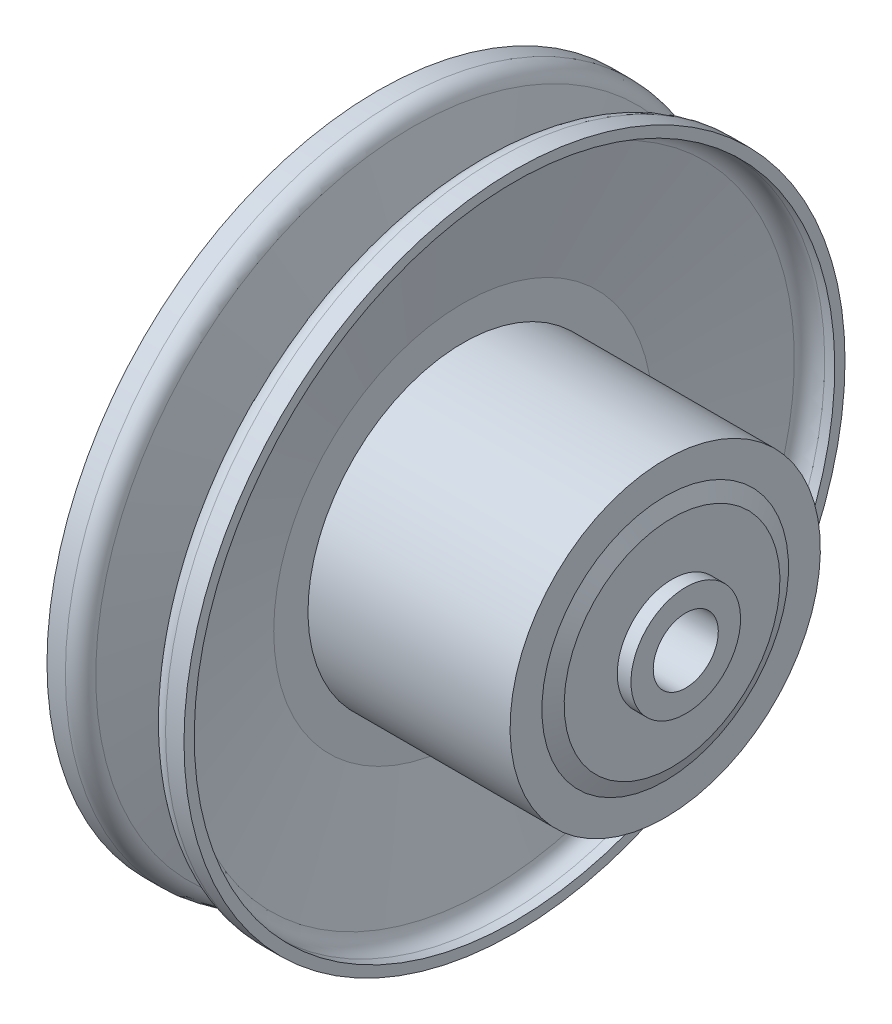
ISO-10303-21;
HEADER;
FILE_DESCRIPTION(('STEP AP214'),'2;1');
FILE_NAME('part.step','',(''),(''),'','','');
FILE_SCHEMA(('AUTOMOTIVE_DESIGN { 1 0 10303 214 1 1 1 1 }'));
ENDSEC;
DATA;
#1=APPLICATION_CONTEXT('core data for automotive mechanical design processes');
#2=APPLICATION_PROTOCOL_DEFINITION('international standard','automotive_design',2000,#1);
#3=PRODUCT_CONTEXT('',#1,'mechanical');
#4=PRODUCT('Part','Part','',(#3));
#5=PRODUCT_RELATED_PRODUCT_CATEGORY('part','',(#4));
#6=PRODUCT_DEFINITION_FORMATION('','',#4);
#7=PRODUCT_DEFINITION_CONTEXT('part definition',#1,'design');
#8=PRODUCT_DEFINITION('design','',#6,#7);
#9=PRODUCT_DEFINITION_SHAPE('','',#8);
#10=(LENGTH_UNIT() NAMED_UNIT(*) SI_UNIT(.MILLI.,.METRE.));
#11=(NAMED_UNIT(*) PLANE_ANGLE_UNIT() SI_UNIT($,.RADIAN.));
#12=(NAMED_UNIT(*) SI_UNIT($,.STERADIAN.) SOLID_ANGLE_UNIT());
#13=UNCERTAINTY_MEASURE_WITH_UNIT(LENGTH_MEASURE(1.E-05),#10,'distance_accuracy_value','');
#14=(GEOMETRIC_REPRESENTATION_CONTEXT(3) GLOBAL_UNCERTAINTY_ASSIGNED_CONTEXT((#13)) GLOBAL_UNIT_ASSIGNED_CONTEXT((#10,
#11,#12)) REPRESENTATION_CONTEXT('',''));
#15=CARTESIAN_POINT('',(0.,0.,0.));
#16=DIRECTION('',(0.,0.,1.));
#17=DIRECTION('',(1.,0.,0.));
#18=AXIS2_PLACEMENT_3D('',#15,#16,#17);
#19=CARTESIAN_POINT('',(-45.,0.,0.));
#20=DIRECTION('',(-1.,0.,0.));
#21=DIRECTION('',(0.,-1.,0.));
#22=AXIS2_PLACEMENT_3D('',#19,#20,#21);
#23=CYLINDRICAL_SURFACE('',#22,45.3);
#24=CARTESIAN_POINT('',(-35.,0.,0.));
#25=DIRECTION('',(-1.,0.,0.));
#26=DIRECTION('',(0.,-1.,0.));
#27=AXIS2_PLACEMENT_3D('',#24,#25,#26);
#28=CIRCLE('',#27,45.3);
#29=CARTESIAN_POINT('',(-35.,-45.3,0.));
#30=VERTEX_POINT('',#29);
#31=EDGE_CURVE('E166',#30,#30,#28,.T.);
#32=ORIENTED_EDGE('',*,*,#31,.F.);
#33=EDGE_LOOP('',(#32));
#34=FACE_BOUND('',#33,.T.);
#35=CARTESIAN_POINT('',(-30.,0.,0.));
#36=DIRECTION('',(-1.,0.,0.));
#37=DIRECTION('',(0.,-1.,0.));
#38=AXIS2_PLACEMENT_3D('',#35,#36,#37);
#39=CIRCLE('',#38,45.3);
#40=CARTESIAN_POINT('',(-30.,-45.3,0.));
#41=VERTEX_POINT('',#40);
#42=EDGE_CURVE('E103',#41,#41,#39,.T.);
#43=ORIENTED_EDGE('',*,*,#42,.T.);
#44=EDGE_LOOP('',(#43));
#45=FACE_BOUND('',#44,.T.);
#46=ADVANCED_FACE('F37',(#34,#45),#23,.T.);
#47=CARTESIAN_POINT('',(-35.,45.3,0.));
#48=DIRECTION('',(1.,0.,0.));
#49=DIRECTION('',(0.,1.,0.));
#50=AXIS2_PLACEMENT_3D('',#47,#48,#49);
#51=PLANE('',#50);
#52=CARTESIAN_POINT('',(-35.,0.,0.));
#53=DIRECTION('',(-1.,0.,0.));
#54=DIRECTION('',(0.,-1.,0.));
#55=AXIS2_PLACEMENT_3D('',#52,#53,#54);
#56=CIRCLE('',#55,14.);
#57=CARTESIAN_POINT('',(-35.,-14.,0.));
#58=VERTEX_POINT('',#57);
#59=EDGE_CURVE('E163',#58,#58,#56,.T.);
#60=ORIENTED_EDGE('',*,*,#59,.F.);
#61=EDGE_LOOP('',(#60));
#62=FACE_BOUND('',#61,.T.);
#63=ORIENTED_EDGE('',*,*,#31,.T.);
#64=EDGE_LOOP('',(#63));
#65=FACE_BOUND('',#64,.T.);
#66=ADVANCED_FACE('F215',(#62,#65),#51,.F.);
#67=CARTESIAN_POINT('',(-45.,0.,0.));
#68=DIRECTION('',(-1.,0.,0.));
#69=DIRECTION('',(0.,-1.,0.));
#70=AXIS2_PLACEMENT_3D('',#67,#68,#69);
#71=CYLINDRICAL_SURFACE('',#70,14.);
#72=CARTESIAN_POINT('',(-40.,0.,0.));
#73=DIRECTION('',(-1.,0.,0.));
#74=DIRECTION('',(0.,-1.,0.));
#75=AXIS2_PLACEMENT_3D('',#72,#73,#74);
#76=CIRCLE('',#75,14.);
#77=CARTESIAN_POINT('',(-40.,-14.,0.));
#78=VERTEX_POINT('',#77);
#79=EDGE_CURVE('E160',#78,#78,#76,.T.);
#80=ORIENTED_EDGE('',*,*,#79,.F.);
#81=EDGE_LOOP('',(#80));
#82=FACE_BOUND('',#81,.T.);
#83=ORIENTED_EDGE('',*,*,#59,.T.);
#84=EDGE_LOOP('',(#83));
#85=FACE_BOUND('',#84,.T.);
#86=ADVANCED_FACE('F221',(#82,#85),#71,.T.);
#87=CARTESIAN_POINT('',(-40.,14.,0.));
#88=DIRECTION('',(1.,0.,0.));
#89=DIRECTION('',(0.,1.,0.));
#90=AXIS2_PLACEMENT_3D('',#87,#88,#89);
#91=PLANE('',#90);
#92=CARTESIAN_POINT('',(-40.,0.,0.));
#93=DIRECTION('',(-1.,0.,0.));
#94=DIRECTION('',(0.,-1.,0.));
#95=AXIS2_PLACEMENT_3D('',#92,#93,#94);
#96=CIRCLE('',#95,9.49999999999999);
#97=CARTESIAN_POINT('',(-40.,-9.49999999999999,0.));
#98=VERTEX_POINT('',#97);
#99=EDGE_CURVE('E157',#98,#98,#96,.T.);
#100=ORIENTED_EDGE('',*,*,#99,.F.);
#101=EDGE_LOOP('',(#100));
#102=FACE_BOUND('',#101,.T.);
#103=ORIENTED_EDGE('',*,*,#79,.T.);
#104=EDGE_LOOP('',(#103));
#105=FACE_BOUND('',#104,.T.);
#106=ADVANCED_FACE('F338',(#102,#105),#91,.F.);
#107=CARTESIAN_POINT('',(-45.,0.,0.));
#108=DIRECTION('',(-1.,0.,0.));
#109=DIRECTION('',(0.,-1.,0.));
#110=AXIS2_PLACEMENT_3D('',#107,#108,#109);
#111=CYLINDRICAL_SURFACE('',#110,9.49999999999999);
#112=DIRECTION('',(-1.,0.,0.));
#113=VECTOR('',#112,1.);
#114=CARTESIAN_POINT('',(-45.,9.16515138991167,-2.5));
#115=LINE('',#114,#113);
#116=CARTESIAN_POINT('',(7.,9.16515138991168,-2.5));
#117=VERTEX_POINT('',#116);
#118=CARTESIAN_POINT('',(-28.,9.16515138991167,-2.5));
#119=VERTEX_POINT('',#118);
#120=EDGE_CURVE('E45',#117,#119,#115,.T.);
#121=ORIENTED_EDGE('',*,*,#120,.T.);
#122=CARTESIAN_POINT('',(-28.,0.,0.));
#123=DIRECTION('',(-1.,0.,0.));
#124=DIRECTION('',(0.,0.,1.));
#125=AXIS2_PLACEMENT_3D('',#122,#123,#124);
#126=CIRCLE('',#125,9.49999999999999);
#127=CARTESIAN_POINT('',(-28.,9.16515138991167,2.5));
#128=VERTEX_POINT('',#127);
#129=EDGE_CURVE('E12',#119,#128,#126,.F.);
#130=ORIENTED_EDGE('',*,*,#129,.T.);
#131=DIRECTION('',(-1.,0.,0.));
#132=VECTOR('',#131,1.);
#133=CARTESIAN_POINT('',(-45.,9.16515138991167,2.5));
#134=LINE('',#133,#132);
#135=CARTESIAN_POINT('',(7.,9.16515138991167,2.5));
#136=VERTEX_POINT('',#135);
#137=EDGE_CURVE('E196',#128,#136,#134,.F.);
#138=ORIENTED_EDGE('',*,*,#137,.T.);
#139=CARTESIAN_POINT('',(7.,0.,0.));
#140=DIRECTION('',(-1.,0.,0.));
#141=DIRECTION('',(0.,-1.,0.));
#142=AXIS2_PLACEMENT_3D('',#139,#140,#141);
#143=CIRCLE('',#142,9.49999999999999);
#144=EDGE_CURVE('E193',#117,#136,#143,.F.);
#145=ORIENTED_EDGE('',*,*,#144,.F.);
#146=EDGE_LOOP('',(#121,#130,#138,#145));
#147=FACE_BOUND('',#146,.T.);
#148=CARTESIAN_POINT('',(45.,0.,0.));
#149=DIRECTION('',(-1.,0.,0.));
#150=DIRECTION('',(0.,-1.,0.));
#151=AXIS2_PLACEMENT_3D('',#148,#149,#150);
#152=CIRCLE('',#151,9.49999999999998);
#153=CARTESIAN_POINT('',(45.,-9.49999999999997,0.));
#154=VERTEX_POINT('',#153);
#155=EDGE_CURVE('E154',#154,#154,#152,.T.);
#156=ORIENTED_EDGE('',*,*,#155,.F.);
#157=EDGE_LOOP('',(#156));
#158=FACE_BOUND('',#157,.T.);
#159=ORIENTED_EDGE('',*,*,#99,.T.);
#160=EDGE_LOOP('',(#159));
#161=FACE_BOUND('',#160,.T.);
#162=ADVANCED_FACE('F197',(#147,#158,#161),#111,.F.);
#163=CARTESIAN_POINT('',(45.,9.5,0.));
#164=DIRECTION('',(-1.,0.,0.));
#165=DIRECTION('',(0.,-1.,0.));
#166=AXIS2_PLACEMENT_3D('',#163,#164,#165);
#167=PLANE('',#166);
#168=CARTESIAN_POINT('',(45.,0.,0.));
#169=DIRECTION('',(-1.,0.,0.));
#170=DIRECTION('',(0.,-1.,0.));
#171=AXIS2_PLACEMENT_3D('',#168,#169,#170);
#172=CIRCLE('',#171,16.);
#173=CARTESIAN_POINT('',(45.,-16.,0.));
#174=VERTEX_POINT('',#173);
#175=EDGE_CURVE('E151',#174,#174,#172,.T.);
#176=ORIENTED_EDGE('',*,*,#175,.F.);
#177=EDGE_LOOP('',(#176));
#178=FACE_BOUND('',#177,.T.);
#179=ORIENTED_EDGE('',*,*,#155,.T.);
#180=EDGE_LOOP('',(#179));
#181=FACE_BOUND('',#180,.T.);
#182=ADVANCED_FACE('F331',(#178,#181),#167,.F.);
#183=CARTESIAN_POINT('',(-45.,0.,0.));
#184=DIRECTION('',(-1.,0.,0.));
#185=DIRECTION('',(0.,-1.,0.));
#186=AXIS2_PLACEMENT_3D('',#183,#184,#185);
#187=CYLINDRICAL_SURFACE('',#186,16.);
#188=CARTESIAN_POINT('',(41.,0.,0.));
#189=DIRECTION('',(-1.,0.,0.));
#190=DIRECTION('',(0.,-1.,0.));
#191=AXIS2_PLACEMENT_3D('',#188,#189,#190);
#192=CIRCLE('',#191,16.);
#193=CARTESIAN_POINT('',(41.,-16.,0.));
#194=VERTEX_POINT('',#193);
#195=EDGE_CURVE('E148',#194,#194,#192,.T.);
#196=ORIENTED_EDGE('',*,*,#195,.F.);
#197=EDGE_LOOP('',(#196));
#198=FACE_BOUND('',#197,.T.);
#199=ORIENTED_EDGE('',*,*,#175,.T.);
#200=EDGE_LOOP('',(#199));
#201=FACE_BOUND('',#200,.T.);
#202=ADVANCED_FACE('F327',(#198,#201),#187,.T.);
#203=CARTESIAN_POINT('',(41.,16.,0.));
#204=DIRECTION('',(-1.,0.,0.));
#205=DIRECTION('',(0.,-1.,0.));
#206=AXIS2_PLACEMENT_3D('',#203,#204,#205);
#207=PLANE('',#206);
#208=CARTESIAN_POINT('',(41.,0.,0.));
#209=DIRECTION('',(-1.,0.,0.));
#210=DIRECTION('',(0.,-1.,0.));
#211=AXIS2_PLACEMENT_3D('',#208,#209,#210);
#212=CIRCLE('',#211,31.5);
#213=CARTESIAN_POINT('',(41.,-31.5,0.));
#214=VERTEX_POINT('',#213);
#215=EDGE_CURVE('E145',#214,#214,#212,.T.);
#216=ORIENTED_EDGE('',*,*,#215,.F.);
#217=EDGE_LOOP('',(#216));
#218=FACE_BOUND('',#217,.T.);
#219=ORIENTED_EDGE('',*,*,#195,.T.);
#220=EDGE_LOOP('',(#219));
#221=FACE_BOUND('',#220,.T.);
#222=ADVANCED_FACE('F323',(#218,#221),#207,.F.);
#223=CARTESIAN_POINT('',(41.,0.,0.));
#224=DIRECTION('',(-1.,0.,0.));
#225=DIRECTION('',(0.,-1.,0.));
#226=AXIS2_PLACEMENT_3D('',#223,#224,#225);
#227=CONICAL_SURFACE('',#226,31.5,1.15257199721567);
#228=CARTESIAN_POINT('',(39.,0.,0.));
#229=DIRECTION('',(-1.,0.,0.));
#230=DIRECTION('',(0.,-1.,0.));
#231=AXIS2_PLACEMENT_3D('',#228,#229,#230);
#232=CIRCLE('',#231,36.);
#233=CARTESIAN_POINT('',(39.,-36.,0.));
#234=VERTEX_POINT('',#233);
#235=EDGE_CURVE('E142',#234,#234,#232,.T.);
#236=ORIENTED_EDGE('',*,*,#235,.F.);
#237=EDGE_LOOP('',(#236));
#238=FACE_BOUND('',#237,.T.);
#239=ORIENTED_EDGE('',*,*,#215,.T.);
#240=EDGE_LOOP('',(#239));
#241=FACE_BOUND('',#240,.T.);
#242=ADVANCED_FACE('F319',(#238,#241),#227,.T.);
#243=CARTESIAN_POINT('',(39.,36.,0.));
#244=DIRECTION('',(-1.,0.,0.));
#245=DIRECTION('',(0.,-1.,0.));
#246=AXIS2_PLACEMENT_3D('',#243,#244,#245);
#247=PLANE('',#246);
#248=CARTESIAN_POINT('',(39.,0.,0.));
#249=DIRECTION('',(-1.,0.,0.));
#250=DIRECTION('',(0.,-1.,0.));
#251=AXIS2_PLACEMENT_3D('',#248,#249,#250);
#252=CIRCLE('',#251,45.3);
#253=CARTESIAN_POINT('',(39.,-45.3,0.));
#254=VERTEX_POINT('',#253);
#255=EDGE_CURVE('E139',#254,#254,#252,.T.);
#256=ORIENTED_EDGE('',*,*,#255,.F.);
#257=EDGE_LOOP('',(#256));
#258=FACE_BOUND('',#257,.T.);
#259=ORIENTED_EDGE('',*,*,#235,.T.);
#260=EDGE_LOOP('',(#259));
#261=FACE_BOUND('',#260,.T.);
#262=ADVANCED_FACE('F315',(#258,#261),#247,.F.);
#263=CARTESIAN_POINT('',(-45.,0.,0.));
#264=DIRECTION('',(-1.,0.,0.));
#265=DIRECTION('',(0.,-1.,0.));
#266=AXIS2_PLACEMENT_3D('',#263,#264,#265);
#267=CYLINDRICAL_SURFACE('',#266,45.3);
#268=CARTESIAN_POINT('',(-20.,0.,0.));
#269=DIRECTION('',(-1.,0.,0.));
#270=DIRECTION('',(0.,-1.,0.));
#271=AXIS2_PLACEMENT_3D('',#268,#269,#270);
#272=CIRCLE('',#271,45.3);
#273=CARTESIAN_POINT('',(-20.,-45.3,0.));
#274=VERTEX_POINT('',#273);
#275=EDGE_CURVE('E136',#274,#274,#272,.T.);
#276=ORIENTED_EDGE('',*,*,#275,.F.);
#277=EDGE_LOOP('',(#276));
#278=FACE_BOUND('',#277,.T.);
#279=ORIENTED_EDGE('',*,*,#255,.T.);
#280=EDGE_LOOP('',(#279));
#281=FACE_BOUND('',#280,.T.);
#282=ADVANCED_FACE('F311',(#278,#281),#267,.T.);
#283=CARTESIAN_POINT('',(-20.,45.3,0.));
#284=DIRECTION('',(-1.,0.,0.));
#285=DIRECTION('',(0.,-1.,0.));
#286=AXIS2_PLACEMENT_3D('',#283,#284,#285);
#287=PLANE('',#286);
#288=CARTESIAN_POINT('',(-20.,0.,0.));
#289=DIRECTION('',(-1.,0.,0.));
#290=DIRECTION('',(0.,-1.,0.));
#291=AXIS2_PLACEMENT_3D('',#288,#289,#290);
#292=CIRCLE('',#291,55.3);
#293=CARTESIAN_POINT('',(-20.,-55.3,0.));
#294=VERTEX_POINT('',#293);
#295=EDGE_CURVE('E133',#294,#294,#292,.T.);
#296=ORIENTED_EDGE('',*,*,#295,.F.);
#297=EDGE_LOOP('',(#296));
#298=FACE_BOUND('',#297,.T.);
#299=ORIENTED_EDGE('',*,*,#275,.T.);
#300=EDGE_LOOP('',(#299));
#301=FACE_BOUND('',#300,.T.);
#302=ADVANCED_FACE('F307',(#298,#301),#287,.F.);
#303=CARTESIAN_POINT('',(-20.,0.,0.));
#304=DIRECTION('',(1.,0.,0.));
#305=DIRECTION('',(0.,1.,0.));
#306=AXIS2_PLACEMENT_3D('',#303,#304,#305);
#307=CONICAL_SURFACE('',#306,55.3,1.36435578748401);
#308=CARTESIAN_POINT('',(-12.8324844774488,0.,0.));
#309=DIRECTION('',(1.,0.,0.));
#310=DIRECTION('',(0.,1.,0.));
#311=AXIS2_PLACEMENT_3D('',#308,#309,#310);
#312=CIRCLE('',#311,89.5248866201821);
#313=CARTESIAN_POINT('',(-12.8324844774488,89.5248866201821,0.));
#314=VERTEX_POINT('',#313);
#315=EDGE_CURVE('E172',#314,#314,#312,.T.);
#316=ORIENTED_EDGE('',*,*,#315,.T.);
#317=EDGE_LOOP('',(#316));
#318=FACE_BOUND('',#317,.T.);
#319=ORIENTED_EDGE('',*,*,#295,.T.);
#320=EDGE_LOOP('',(#319));
#321=FACE_BOUND('',#320,.T.);
#322=ADVANCED_FACE('F303',(#318,#321),#307,.F.);
#323=CARTESIAN_POINT('',(-45.,0.,0.));
#324=DIRECTION('',(-1.,0.,0.));
#325=DIRECTION('',(0.,-1.,0.));
#326=AXIS2_PLACEMENT_3D('',#323,#324,#325);
#327=CYLINDRICAL_SURFACE('',#326,93.5);
#328=CARTESIAN_POINT('',(-7.93865086607908,0.,0.));
#329=DIRECTION('',(-1.,0.,0.));
#330=DIRECTION('',(0.,-1.,0.));
#331=AXIS2_PLACEMENT_3D('',#328,#329,#330);
#332=CIRCLE('',#331,93.5);
#333=CARTESIAN_POINT('',(-7.93865086607906,-93.5,0.));
#334=VERTEX_POINT('',#333);
#335=EDGE_CURVE('E169',#334,#334,#332,.T.);
#336=ORIENTED_EDGE('',*,*,#335,.T.);
#337=EDGE_LOOP('',(#336));
#338=FACE_BOUND('',#337,.T.);
#339=CARTESIAN_POINT('',(-5.,0.,0.));
#340=DIRECTION('',(-1.,0.,0.));
#341=DIRECTION('',(0.,-1.,0.));
#342=AXIS2_PLACEMENT_3D('',#339,#340,#341);
#343=CIRCLE('',#342,93.5);
#344=CARTESIAN_POINT('',(-4.99999999999998,-93.5,0.));
#345=VERTEX_POINT('',#344);
#346=EDGE_CURVE('E130',#345,#345,#343,.T.);
#347=ORIENTED_EDGE('',*,*,#346,.F.);
#348=EDGE_LOOP('',(#347));
#349=FACE_BOUND('',#348,.T.);
#350=ADVANCED_FACE('F299',(#338,#349),#327,.F.);
#351=CARTESIAN_POINT('',(-5.00000000000001,93.5,0.));
#352=DIRECTION('',(-1.,0.,0.));
#353=DIRECTION('',(0.,-1.,0.));
#354=AXIS2_PLACEMENT_3D('',#351,#352,#353);
#355=PLANE('',#354);
#356=CARTESIAN_POINT('',(-4.99999999999998,0.,0.));
#357=DIRECTION('',(-1.,0.,0.));
#358=DIRECTION('',(0.,-1.,0.));
#359=AXIS2_PLACEMENT_3D('',#356,#357,#358);
#360=CIRCLE('',#359,96.5);
#361=CARTESIAN_POINT('',(-4.99999999999997,-96.5,0.));
#362=VERTEX_POINT('',#361);
#363=EDGE_CURVE('E127',#362,#362,#360,.T.);
#364=ORIENTED_EDGE('',*,*,#363,.F.);
#365=EDGE_LOOP('',(#364));
#366=FACE_BOUND('',#365,.T.);
#367=ORIENTED_EDGE('',*,*,#346,.T.);
#368=EDGE_LOOP('',(#367));
#369=FACE_BOUND('',#368,.T.);
#370=ADVANCED_FACE('F295',(#366,#369),#355,.F.);
#371=CARTESIAN_POINT('',(-45.,0.,0.));
#372=DIRECTION('',(-1.,0.,0.));
#373=DIRECTION('',(0.,-1.,0.));
#374=AXIS2_PLACEMENT_3D('',#371,#372,#373);
#375=CYLINDRICAL_SURFACE('',#374,96.5);
#376=CARTESIAN_POINT('',(-10.3754603464316,0.,0.));
#377=DIRECTION('',(1.,0.,0.));
#378=DIRECTION('',(0.,1.,0.));
#379=AXIS2_PLACEMENT_3D('',#376,#377,#378);
#380=CIRCLE('',#379,96.5);
#381=CARTESIAN_POINT('',(-10.3754603464317,96.5,0.));
#382=VERTEX_POINT('',#381);
#383=EDGE_CURVE('E178',#382,#382,#380,.T.);
#384=ORIENTED_EDGE('',*,*,#383,.T.);
#385=EDGE_LOOP('',(#384));
#386=FACE_BOUND('',#385,.T.);
#387=ORIENTED_EDGE('',*,*,#363,.T.);
#388=EDGE_LOOP('',(#387));
#389=FACE_BOUND('',#388,.T.);
#390=ADVANCED_FACE('F291',(#386,#389),#375,.T.);
#391=CARTESIAN_POINT('',(-14.4368094803525,0.,0.));
#392=DIRECTION('',(1.,0.,0.));
#393=DIRECTION('',(0.,1.,0.));
#394=AXIS2_PLACEMENT_3D('',#391,#392,#393);
#395=CONICAL_SURFACE('',#394,96.5,1.36435578748401);
#396=CARTESIAN_POINT('',(-15.2692939578013,0.,0.));
#397=DIRECTION('',(-1.,0.,0.));
#398=DIRECTION('',(0.,-1.,0.));
#399=AXIS2_PLACEMENT_3D('',#396,#397,#398);
#400=CIRCLE('',#399,92.5248866201821);
#401=CARTESIAN_POINT('',(-15.2692939578013,-92.5248866201821,0.));
#402=VERTEX_POINT('',#401);
#403=EDGE_CURVE('E175',#402,#402,#400,.T.);
#404=ORIENTED_EDGE('',*,*,#403,.T.);
#405=EDGE_LOOP('',(#404));
#406=FACE_BOUND('',#405,.T.);
#407=CARTESIAN_POINT('',(-23.,0.,0.));
#408=DIRECTION('',(-1.,0.,0.));
#409=DIRECTION('',(0.,-1.,0.));
#410=AXIS2_PLACEMENT_3D('',#407,#408,#409);
#411=CIRCLE('',#410,55.6107652686834);
#412=CARTESIAN_POINT('',(-23.,-55.6107652686834,0.));
#413=VERTEX_POINT('',#412);
#414=EDGE_CURVE('E124',#413,#413,#411,.T.);
#415=ORIENTED_EDGE('',*,*,#414,.F.);
#416=EDGE_LOOP('',(#415));
#417=FACE_BOUND('',#416,.T.);
#418=ADVANCED_FACE('F287',(#406,#417),#395,.T.);
#419=CARTESIAN_POINT('',(-23.,55.6107652686834,0.));
#420=DIRECTION('',(1.,0.,0.));
#421=DIRECTION('',(0.,1.,0.));
#422=AXIS2_PLACEMENT_3D('',#419,#420,#421);
#423=PLANE('',#422);
#424=CARTESIAN_POINT('',(-23.,0.,0.));
#425=DIRECTION('',(-1.,0.,0.));
#426=DIRECTION('',(0.,-1.,0.));
#427=AXIS2_PLACEMENT_3D('',#424,#425,#426);
#428=CIRCLE('',#427,35.);
#429=CARTESIAN_POINT('',(-23.,-35.,0.));
#430=VERTEX_POINT('',#429);
#431=EDGE_CURVE('E121',#430,#430,#428,.T.);
#432=ORIENTED_EDGE('',*,*,#431,.F.);
#433=EDGE_LOOP('',(#432));
#434=FACE_BOUND('',#433,.T.);
#435=ORIENTED_EDGE('',*,*,#414,.T.);
#436=EDGE_LOOP('',(#435));
#437=FACE_BOUND('',#436,.T.);
#438=ADVANCED_FACE('F283',(#434,#437),#423,.F.);
#439=CARTESIAN_POINT('',(-45.,0.,0.));
#440=DIRECTION('',(-1.,0.,0.));
#441=DIRECTION('',(0.,-1.,0.));
#442=AXIS2_PLACEMENT_3D('',#439,#440,#441);
#443=CYLINDRICAL_SURFACE('',#442,35.);
#444=CARTESIAN_POINT('',(-27.,0.,0.));
#445=DIRECTION('',(-1.,0.,0.));
#446=DIRECTION('',(0.,-1.,0.));
#447=AXIS2_PLACEMENT_3D('',#444,#445,#446);
#448=CIRCLE('',#447,35.);
#449=CARTESIAN_POINT('',(-27.,-35.,0.));
#450=VERTEX_POINT('',#449);
#451=EDGE_CURVE('E118',#450,#450,#448,.T.);
#452=ORIENTED_EDGE('',*,*,#451,.F.);
#453=EDGE_LOOP('',(#452));
#454=FACE_BOUND('',#453,.T.);
#455=ORIENTED_EDGE('',*,*,#431,.T.);
#456=EDGE_LOOP('',(#455));
#457=FACE_BOUND('',#456,.T.);
#458=ADVANCED_FACE('F279',(#454,#457),#443,.T.);
#459=CARTESIAN_POINT('',(-27.,35.,0.));
#460=DIRECTION('',(-1.,0.,0.));
#461=DIRECTION('',(0.,-1.,0.));
#462=AXIS2_PLACEMENT_3D('',#459,#460,#461);
#463=PLANE('',#462);
#464=CARTESIAN_POINT('',(-27.,0.,0.));
#465=DIRECTION('',(-1.,0.,0.));
#466=DIRECTION('',(0.,-1.,0.));
#467=AXIS2_PLACEMENT_3D('',#464,#465,#466);
#468=CIRCLE('',#467,55.6107652686834);
#469=CARTESIAN_POINT('',(-27.,-55.6107652686834,0.));
#470=VERTEX_POINT('',#469);
#471=EDGE_CURVE('E115',#470,#470,#468,.T.);
#472=ORIENTED_EDGE('',*,*,#471,.F.);
#473=EDGE_LOOP('',(#472));
#474=FACE_BOUND('',#473,.T.);
#475=ORIENTED_EDGE('',*,*,#451,.T.);
#476=EDGE_LOOP('',(#475));
#477=FACE_BOUND('',#476,.T.);
#478=ADVANCED_FACE('F275',(#474,#477),#463,.F.);
#479=CARTESIAN_POINT('',(-27.,0.,0.));
#480=DIRECTION('',(-1.,0.,0.));
#481=DIRECTION('',(0.,-1.,0.));
#482=AXIS2_PLACEMENT_3D('',#479,#480,#481);
#483=CONICAL_SURFACE('',#482,55.6107652686834,1.36435578748401);
#484=CARTESIAN_POINT('',(-34.7307060421987,0.,0.));
#485=DIRECTION('',(1.,0.,0.));
#486=DIRECTION('',(0.,1.,0.));
#487=AXIS2_PLACEMENT_3D('',#484,#485,#486);
#488=CIRCLE('',#487,92.5248866201821);
#489=CARTESIAN_POINT('',(-34.7307060421987,92.5248866201821,0.));
#490=VERTEX_POINT('',#489);
#491=EDGE_CURVE('E190',#490,#490,#488,.T.);
#492=ORIENTED_EDGE('',*,*,#491,.T.);
#493=EDGE_LOOP('',(#492));
#494=FACE_BOUND('',#493,.T.);
#495=ORIENTED_EDGE('',*,*,#471,.T.);
#496=EDGE_LOOP('',(#495));
#497=FACE_BOUND('',#496,.T.);
#498=ADVANCED_FACE('F271',(#494,#497),#483,.T.);
#499=CARTESIAN_POINT('',(-45.,0.,0.));
#500=DIRECTION('',(-1.,0.,0.));
#501=DIRECTION('',(0.,-1.,0.));
#502=AXIS2_PLACEMENT_3D('',#499,#500,#501);
#503=CYLINDRICAL_SURFACE('',#502,96.5);
#504=CARTESIAN_POINT('',(-39.6245396535684,0.,0.));
#505=DIRECTION('',(1.,0.,0.));
#506=DIRECTION('',(0.,1.,0.));
#507=AXIS2_PLACEMENT_3D('',#504,#505,#506);
#508=CIRCLE('',#507,96.5);
#509=CARTESIAN_POINT('',(-39.6245396535684,96.5,0.));
#510=VERTEX_POINT('',#509);
#511=EDGE_CURVE('E187',#510,#510,#508,.F.);
#512=ORIENTED_EDGE('',*,*,#511,.T.);
#513=EDGE_LOOP('',(#512));
#514=FACE_BOUND('',#513,.T.);
#515=CARTESIAN_POINT('',(-45.,0.,0.));
#516=DIRECTION('',(-1.,0.,0.));
#517=DIRECTION('',(0.,-1.,0.));
#518=AXIS2_PLACEMENT_3D('',#515,#516,#517);
#519=CIRCLE('',#518,96.5);
#520=CARTESIAN_POINT('',(-45.,-96.5,0.));
#521=VERTEX_POINT('',#520);
#522=EDGE_CURVE('E112',#521,#521,#519,.T.);
#523=ORIENTED_EDGE('',*,*,#522,.F.);
#524=EDGE_LOOP('',(#523));
#525=FACE_BOUND('',#524,.T.);
#526=ADVANCED_FACE('F267',(#514,#525),#503,.T.);
#527=CARTESIAN_POINT('',(-45.,96.5,0.));
#528=DIRECTION('',(1.,0.,0.));
#529=DIRECTION('',(0.,1.,0.));
#530=AXIS2_PLACEMENT_3D('',#527,#528,#529);
#531=PLANE('',#530);
#532=CARTESIAN_POINT('',(-45.,0.,0.));
#533=DIRECTION('',(-1.,0.,0.));
#534=DIRECTION('',(0.,-1.,0.));
#535=AXIS2_PLACEMENT_3D('',#532,#533,#534);
#536=CIRCLE('',#535,93.5);
#537=CARTESIAN_POINT('',(-45.,-93.5,0.));
#538=VERTEX_POINT('',#537);
#539=EDGE_CURVE('E109',#538,#538,#536,.T.);
#540=ORIENTED_EDGE('',*,*,#539,.F.);
#541=EDGE_LOOP('',(#540));
#542=FACE_BOUND('',#541,.T.);
#543=ORIENTED_EDGE('',*,*,#522,.T.);
#544=EDGE_LOOP('',(#543));
#545=FACE_BOUND('',#544,.T.);
#546=ADVANCED_FACE('F263',(#542,#545),#531,.F.);
#547=CARTESIAN_POINT('',(-45.,0.,0.));
#548=DIRECTION('',(-1.,0.,0.));
#549=DIRECTION('',(0.,-1.,0.));
#550=AXIS2_PLACEMENT_3D('',#547,#548,#549);
#551=CYLINDRICAL_SURFACE('',#550,93.5);
#552=CARTESIAN_POINT('',(-42.0613491339209,0.,0.));
#553=DIRECTION('',(-1.,0.,0.));
#554=DIRECTION('',(0.,-1.,0.));
#555=AXIS2_PLACEMENT_3D('',#552,#553,#554);
#556=CIRCLE('',#555,93.5);
#557=CARTESIAN_POINT('',(-42.0613491339209,-93.5,0.));
#558=VERTEX_POINT('',#557);
#559=EDGE_CURVE('E184',#558,#558,#556,.F.);
#560=ORIENTED_EDGE('',*,*,#559,.T.);
#561=EDGE_LOOP('',(#560));
#562=FACE_BOUND('',#561,.T.);
#563=ORIENTED_EDGE('',*,*,#539,.T.);
#564=EDGE_LOOP('',(#563));
#565=FACE_BOUND('',#564,.T.);
#566=ADVANCED_FACE('F250',(#562,#565),#551,.F.);
#567=CARTESIAN_POINT('',(-38.,0.,0.));
#568=DIRECTION('',(-1.,0.,0.));
#569=DIRECTION('',(0.,-1.,0.));
#570=AXIS2_PLACEMENT_3D('',#567,#568,#569);
#571=CONICAL_SURFACE('',#570,93.5,1.36435578748401);
#572=CARTESIAN_POINT('',(-37.1675155225512,0.,0.));
#573=DIRECTION('',(-1.,0.,0.));
#574=DIRECTION('',(0.,-1.,0.));
#575=AXIS2_PLACEMENT_3D('',#572,#573,#574);
#576=CIRCLE('',#575,89.5248866201821);
#577=CARTESIAN_POINT('',(-37.1675155225512,-89.5248866201821,0.));
#578=VERTEX_POINT('',#577);
#579=EDGE_CURVE('E181',#578,#578,#576,.T.);
#580=ORIENTED_EDGE('',*,*,#579,.T.);
#581=EDGE_LOOP('',(#580));
#582=FACE_BOUND('',#581,.T.);
#583=CARTESIAN_POINT('',(-30.,0.,0.));
#584=DIRECTION('',(-1.,0.,0.));
#585=DIRECTION('',(0.,-1.,0.));
#586=AXIS2_PLACEMENT_3D('',#583,#584,#585);
#587=CIRCLE('',#586,55.3);
#588=CARTESIAN_POINT('',(-30.,-55.3,0.));
#589=VERTEX_POINT('',#588);
#590=EDGE_CURVE('E106',#589,#589,#587,.T.);
#591=ORIENTED_EDGE('',*,*,#590,.F.);
#592=EDGE_LOOP('',(#591));
#593=FACE_BOUND('',#592,.T.);
#594=ADVANCED_FACE('F247',(#582,#593),#571,.F.);
#595=CARTESIAN_POINT('',(-30.,55.3,0.));
#596=DIRECTION('',(1.,0.,0.));
#597=DIRECTION('',(0.,1.,0.));
#598=AXIS2_PLACEMENT_3D('',#595,#596,#597);
#599=PLANE('',#598);
#600=ORIENTED_EDGE('',*,*,#42,.F.);
#601=EDGE_LOOP('',(#600));
#602=FACE_BOUND('',#601,.T.);
#603=ORIENTED_EDGE('',*,*,#590,.T.);
#604=EDGE_LOOP('',(#603));
#605=FACE_BOUND('',#604,.T.);
#606=ADVANCED_FACE('F232',(#602,#605),#599,.F.);
#607=CARTESIAN_POINT('',(-7.93865086607908,0.,0.));
#608=DIRECTION('',(-1.,0.,0.));
#609=DIRECTION('',(0.,-1.,0.));
#610=AXIS2_PLACEMENT_3D('',#607,#608,#609);
#611=TOROIDAL_SURFACE('',#610,88.5,5.);
#612=ORIENTED_EDGE('',*,*,#315,.F.);
#613=EDGE_LOOP('',(#612));
#614=FACE_BOUND('',#613,.T.);
#615=ORIENTED_EDGE('',*,*,#335,.F.);
#616=EDGE_LOOP('',(#615));
#617=FACE_BOUND('',#616,.T.);
#618=ADVANCED_FACE('F228',(#614,#617),#611,.F.);
#619=CARTESIAN_POINT('',(-10.3754603464316,0.,0.));
#620=DIRECTION('',(1.,0.,0.));
#621=DIRECTION('',(0.,1.,0.));
#622=AXIS2_PLACEMENT_3D('',#619,#620,#621);
#623=TOROIDAL_SURFACE('',#622,91.5,5.);
#624=ORIENTED_EDGE('',*,*,#383,.F.);
#625=EDGE_LOOP('',(#624));
#626=FACE_BOUND('',#625,.T.);
#627=ORIENTED_EDGE('',*,*,#403,.F.);
#628=EDGE_LOOP('',(#627));
#629=FACE_BOUND('',#628,.T.);
#630=ADVANCED_FACE('F231',(#626,#629),#623,.T.);
#631=CARTESIAN_POINT('',(-42.0613491339209,0.,0.));
#632=DIRECTION('',(-1.,0.,0.));
#633=DIRECTION('',(0.,-1.,0.));
#634=AXIS2_PLACEMENT_3D('',#631,#632,#633);
#635=TOROIDAL_SURFACE('',#634,88.5,5.);
#636=ORIENTED_EDGE('',*,*,#559,.F.);
#637=EDGE_LOOP('',(#636));
#638=FACE_BOUND('',#637,.T.);
#639=ORIENTED_EDGE('',*,*,#579,.F.);
#640=EDGE_LOOP('',(#639));
#641=FACE_BOUND('',#640,.T.);
#642=ADVANCED_FACE('F235',(#638,#641),#635,.F.);
#643=CARTESIAN_POINT('',(-39.6245396535684,0.,0.));
#644=DIRECTION('',(1.,0.,0.));
#645=DIRECTION('',(0.,1.,0.));
#646=AXIS2_PLACEMENT_3D('',#643,#644,#645);
#647=TOROIDAL_SURFACE('',#646,91.5,5.);
#648=ORIENTED_EDGE('',*,*,#491,.F.);
#649=EDGE_LOOP('',(#648));
#650=FACE_BOUND('',#649,.T.);
#651=ORIENTED_EDGE('',*,*,#511,.F.);
#652=EDGE_LOOP('',(#651));
#653=FACE_BOUND('',#652,.T.);
#654=ADVANCED_FACE('F39',(#650,#653),#647,.T.);
#655=CARTESIAN_POINT('',(52.0710678118655,12.,-2.5));
#656=DIRECTION('',(0.,0.,-1.));
#657=DIRECTION('',(0.,1.,0.));
#658=AXIS2_PLACEMENT_3D('',#655,#656,#657);
#659=PLANE('',#658);
#660=ORIENTED_EDGE('',*,*,#120,.F.);
#661=DIRECTION('',(0.,1.,0.));
#662=VECTOR('',#661,1.);
#663=CARTESIAN_POINT('',(7.,12.,-2.5));
#664=LINE('',#663,#662);
#665=CARTESIAN_POINT('',(7.,7.,-2.5));
#666=VERTEX_POINT('',#665);
#667=EDGE_CURVE('E86',#666,#117,#664,.T.);
#668=ORIENTED_EDGE('',*,*,#667,.F.);
#669=DIRECTION('',(-1.,0.,0.));
#670=VECTOR('',#669,1.);
#671=CARTESIAN_POINT('',(52.0710678118655,7.00000000000001,-2.5));
#672=LINE('',#671,#670);
#673=CARTESIAN_POINT('',(-28.,6.99999999999999,-2.5));
#674=VERTEX_POINT('',#673);
#675=EDGE_CURVE('E83',#666,#674,#672,.T.);
#676=ORIENTED_EDGE('',*,*,#675,.T.);
#677=DIRECTION('',(0.,-1.,0.));
#678=VECTOR('',#677,1.);
#679=CARTESIAN_POINT('',(-28.,12.,-2.5));
#680=LINE('',#679,#678);
#681=EDGE_CURVE('E73',#119,#674,#680,.T.);
#682=ORIENTED_EDGE('',*,*,#681,.F.);
#683=EDGE_LOOP('',(#660,#668,#676,#682));
#684=FACE_BOUND('',#683,.T.);
#685=ADVANCED_FACE('F84',(#684),#659,.T.);
#686=CARTESIAN_POINT('',(52.0710678118655,12.,2.5));
#687=DIRECTION('',(0.,0.,1.));
#688=DIRECTION('',(0.,-1.,0.));
#689=AXIS2_PLACEMENT_3D('',#686,#687,#688);
#690=PLANE('',#689);
#691=ORIENTED_EDGE('',*,*,#137,.F.);
#692=DIRECTION('',(0.,1.,0.));
#693=VECTOR('',#692,1.);
#694=CARTESIAN_POINT('',(-28.,12.,2.5));
#695=LINE('',#694,#693);
#696=CARTESIAN_POINT('',(-28.,6.99999999999999,2.5));
#697=VERTEX_POINT('',#696);
#698=EDGE_CURVE('E90',#697,#128,#695,.T.);
#699=ORIENTED_EDGE('',*,*,#698,.F.);
#700=DIRECTION('',(-1.,0.,0.));
#701=VECTOR('',#700,1.);
#702=CARTESIAN_POINT('',(52.0710678118655,7.00000000000001,2.5));
#703=LINE('',#702,#701);
#704=CARTESIAN_POINT('',(7.,7.,2.5));
#705=VERTEX_POINT('',#704);
#706=EDGE_CURVE('E89',#705,#697,#703,.T.);
#707=ORIENTED_EDGE('',*,*,#706,.F.);
#708=DIRECTION('',(0.,-1.,0.));
#709=VECTOR('',#708,1.);
#710=CARTESIAN_POINT('',(7.,12.,2.5));
#711=LINE('',#710,#709);
#712=EDGE_CURVE('E99',#136,#705,#711,.T.);
#713=ORIENTED_EDGE('',*,*,#712,.F.);
#714=EDGE_LOOP('',(#691,#699,#707,#713));
#715=FACE_BOUND('',#714,.T.);
#716=ADVANCED_FACE('F203',(#715),#690,.T.);
#717=CARTESIAN_POINT('',(-28.,0.,0.));
#718=DIRECTION('',(-1.,0.,0.));
#719=DIRECTION('',(0.,0.,1.));
#720=AXIS2_PLACEMENT_3D('',#717,#718,#719);
#721=PLANE('',#720);
#722=ORIENTED_EDGE('',*,*,#129,.F.);
#723=ORIENTED_EDGE('',*,*,#681,.T.);
#724=DIRECTION('',(0.,0.,1.));
#725=VECTOR('',#724,1.);
#726=CARTESIAN_POINT('',(-28.,6.99999999999999,-2.5));
#727=LINE('',#726,#725);
#728=EDGE_CURVE('E78',#674,#697,#727,.T.);
#729=ORIENTED_EDGE('',*,*,#728,.T.);
#730=ORIENTED_EDGE('',*,*,#698,.T.);
#731=EDGE_LOOP('',(#722,#723,#729,#730));
#732=FACE_BOUND('',#731,.T.);
#733=ADVANCED_FACE('F75',(#732),#721,.T.);
#734=CARTESIAN_POINT('',(7.,9.49999999999999,0.));
#735=DIRECTION('',(-1.,0.,0.));
#736=DIRECTION('',(0.,-1.,0.));
#737=AXIS2_PLACEMENT_3D('',#734,#735,#736);
#738=PLANE('',#737);
#739=ORIENTED_EDGE('',*,*,#667,.T.);
#740=ORIENTED_EDGE('',*,*,#144,.T.);
#741=ORIENTED_EDGE('',*,*,#712,.T.);
#742=DIRECTION('',(0.,0.,-1.));
#743=VECTOR('',#742,1.);
#744=CARTESIAN_POINT('',(7.,7.,-2.5));
#745=LINE('',#744,#743);
#746=EDGE_CURVE('E101',#705,#666,#745,.T.);
#747=ORIENTED_EDGE('',*,*,#746,.T.);
#748=EDGE_LOOP('',(#739,#740,#741,#747));
#749=FACE_BOUND('',#748,.T.);
#750=ADVANCED_FACE('F202',(#749),#738,.F.);
#751=CARTESIAN_POINT('',(52.0710678118655,7.00000000000001,-2.5));
#752=DIRECTION('',(0.,-1.,0.));
#753=DIRECTION('',(1.,0.,0.));
#754=AXIS2_PLACEMENT_3D('',#751,#752,#753);
#755=PLANE('',#754);
#756=ORIENTED_EDGE('',*,*,#746,.F.);
#757=ORIENTED_EDGE('',*,*,#706,.T.);
#758=ORIENTED_EDGE('',*,*,#728,.F.);
#759=ORIENTED_EDGE('',*,*,#675,.F.);
#760=EDGE_LOOP('',(#756,#757,#758,#759));
#761=FACE_BOUND('',#760,.T.);
#762=ADVANCED_FACE('F92',(#761),#755,.T.);
#763=CLOSED_SHELL('',(#46,#66,#86,#106,#162,#182,#202,#222,#242,#262,#282,#302,#322,#350,#370,
#390,#418,#438,#458,#478,#498,#526,#546,#566,#594,#606,#618,#630,#642,#654,#685,#716,#733,#750,#762));
#764=MANIFOLD_SOLID_BREP('B2',#763);
#765=ADVANCED_BREP_SHAPE_REPRESENTATION('',(#18,#764),#14);
#766=SHAPE_DEFINITION_REPRESENTATION(#9,#765);
ENDSEC;
END-ISO-10303-21;
